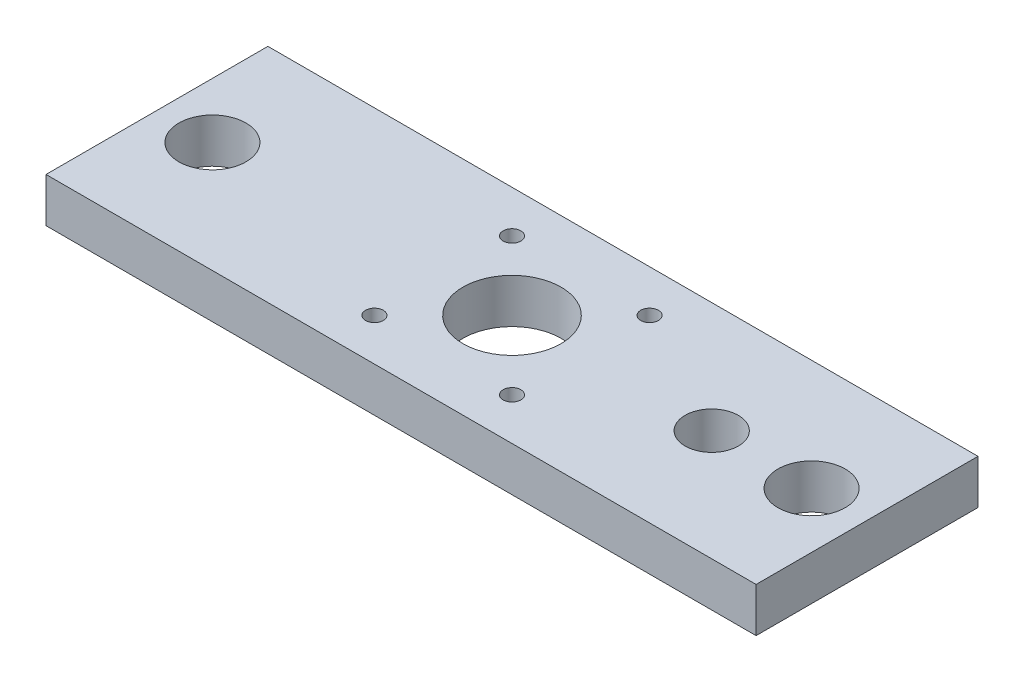
ISO-10303-21;
HEADER;
FILE_DESCRIPTION(('STEP AP214'),'2;1');
FILE_NAME('part.step','',(''),(''),'','','');
FILE_SCHEMA(('AUTOMOTIVE_DESIGN { 1 0 10303 214 1 1 1 1 }'));
ENDSEC;
DATA;
#1=APPLICATION_CONTEXT('core data for automotive mechanical design processes');
#2=APPLICATION_PROTOCOL_DEFINITION('international standard','automotive_design',2000,#1);
#3=PRODUCT_CONTEXT('',#1,'mechanical');
#4=PRODUCT('Part','Part','',(#3));
#5=PRODUCT_RELATED_PRODUCT_CATEGORY('part','',(#4));
#6=PRODUCT_DEFINITION_FORMATION('','',#4);
#7=PRODUCT_DEFINITION_CONTEXT('part definition',#1,'design');
#8=PRODUCT_DEFINITION('design','',#6,#7);
#9=PRODUCT_DEFINITION_SHAPE('','',#8);
#10=(LENGTH_UNIT() NAMED_UNIT(*) SI_UNIT(.MILLI.,.METRE.));
#11=(NAMED_UNIT(*) PLANE_ANGLE_UNIT() SI_UNIT($,.RADIAN.));
#12=(NAMED_UNIT(*) SI_UNIT($,.STERADIAN.) SOLID_ANGLE_UNIT());
#13=UNCERTAINTY_MEASURE_WITH_UNIT(LENGTH_MEASURE(1.E-05),#10,'distance_accuracy_value','');
#14=(GEOMETRIC_REPRESENTATION_CONTEXT(3) GLOBAL_UNCERTAINTY_ASSIGNED_CONTEXT((#13)) GLOBAL_UNIT_ASSIGNED_CONTEXT((#10,
#11,#12)) REPRESENTATION_CONTEXT('',''));
#15=CARTESIAN_POINT('',(0.,0.,0.));
#16=DIRECTION('',(0.,0.,1.));
#17=DIRECTION('',(1.,0.,0.));
#18=AXIS2_PLACEMENT_3D('',#15,#16,#17);
#19=CARTESIAN_POINT('',(0.,10.,0.));
#20=DIRECTION('',(0.,-1.,0.));
#21=DIRECTION('',(0.,0.,-1.));
#22=AXIS2_PLACEMENT_3D('',#19,#20,#21);
#23=PLANE('',#22);
#24=DIRECTION('',(0.,0.,-1.));
#25=VECTOR('',#24,1.);
#26=CARTESIAN_POINT('',(80.,10.,25.));
#27=LINE('',#26,#25);
#28=CARTESIAN_POINT('',(80.,10.,25.));
#29=VERTEX_POINT('',#28);
#30=CARTESIAN_POINT('',(80.,10.,-25.));
#31=VERTEX_POINT('',#30);
#32=EDGE_CURVE('E88',#29,#31,#27,.T.);
#33=ORIENTED_EDGE('',*,*,#32,.T.);
#34=DIRECTION('',(-1.,0.,0.));
#35=VECTOR('',#34,1.);
#36=CARTESIAN_POINT('',(-80.,10.,-25.));
#37=LINE('',#36,#35);
#38=CARTESIAN_POINT('',(-80.,10.,-25.));
#39=VERTEX_POINT('',#38);
#40=EDGE_CURVE('E83',#31,#39,#37,.T.);
#41=ORIENTED_EDGE('',*,*,#40,.T.);
#42=DIRECTION('',(0.,0.,1.));
#43=VECTOR('',#42,1.);
#44=CARTESIAN_POINT('',(-80.,10.,25.));
#45=LINE('',#44,#43);
#46=CARTESIAN_POINT('',(-80.,10.,25.));
#47=VERTEX_POINT('',#46);
#48=EDGE_CURVE('E86',#39,#47,#45,.T.);
#49=ORIENTED_EDGE('',*,*,#48,.T.);
#50=DIRECTION('',(1.,0.,0.));
#51=VECTOR('',#50,1.);
#52=CARTESIAN_POINT('',(-80.,10.,25.));
#53=LINE('',#52,#51);
#54=EDGE_CURVE('E53',#47,#29,#53,.T.);
#55=ORIENTED_EDGE('',*,*,#54,.T.);
#56=EDGE_LOOP('',(#33,#41,#49,#55));
#57=FACE_BOUND('',#56,.T.);
#58=CARTESIAN_POINT('',(0.,10.,0.));
#59=DIRECTION('',(0.,1.,0.));
#60=DIRECTION('',(0.,0.,1.));
#61=AXIS2_PLACEMENT_3D('',#58,#59,#60);
#62=CIRCLE('',#61,11.05);
#63=CARTESIAN_POINT('',(0.,10.,11.05));
#64=VERTEX_POINT('',#63);
#65=EDGE_CURVE('E103',#64,#64,#62,.T.);
#66=ORIENTED_EDGE('',*,*,#65,.F.);
#67=EDGE_LOOP('',(#66));
#68=FACE_BOUND('',#67,.T.);
#69=CARTESIAN_POINT('',(15.5,10.,-15.5));
#70=DIRECTION('',(0.,1.,0.));
#71=DIRECTION('',(0.,0.,1.));
#72=AXIS2_PLACEMENT_3D('',#69,#70,#71);
#73=CIRCLE('',#72,2.);
#74=CARTESIAN_POINT('',(15.5,10.,-13.5));
#75=VERTEX_POINT('',#74);
#76=EDGE_CURVE('E118',#75,#75,#73,.T.);
#77=ORIENTED_EDGE('',*,*,#76,.F.);
#78=EDGE_LOOP('',(#77));
#79=FACE_BOUND('',#78,.T.);
#80=CARTESIAN_POINT('',(-15.5,10.,-15.5));
#81=DIRECTION('',(0.,1.,0.));
#82=DIRECTION('',(0.,0.,1.));
#83=AXIS2_PLACEMENT_3D('',#80,#81,#82);
#84=CIRCLE('',#83,2.);
#85=CARTESIAN_POINT('',(-15.5,10.,-13.5));
#86=VERTEX_POINT('',#85);
#87=EDGE_CURVE('E124',#86,#86,#84,.T.);
#88=ORIENTED_EDGE('',*,*,#87,.F.);
#89=EDGE_LOOP('',(#88));
#90=FACE_BOUND('',#89,.T.);
#91=CARTESIAN_POINT('',(-15.5,10.,15.5));
#92=DIRECTION('',(0.,1.,0.));
#93=DIRECTION('',(0.,0.,1.));
#94=AXIS2_PLACEMENT_3D('',#91,#92,#93);
#95=CIRCLE('',#94,2.);
#96=CARTESIAN_POINT('',(-15.5,10.,17.5));
#97=VERTEX_POINT('',#96);
#98=EDGE_CURVE('E130',#97,#97,#95,.T.);
#99=ORIENTED_EDGE('',*,*,#98,.F.);
#100=EDGE_LOOP('',(#99));
#101=FACE_BOUND('',#100,.T.);
#102=CARTESIAN_POINT('',(15.5,10.,15.5));
#103=DIRECTION('',(0.,1.,0.));
#104=DIRECTION('',(0.,0.,1.));
#105=AXIS2_PLACEMENT_3D('',#102,#103,#104);
#106=CIRCLE('',#105,2.);
#107=CARTESIAN_POINT('',(15.5,10.,17.5));
#108=VERTEX_POINT('',#107);
#109=EDGE_CURVE('E136',#108,#108,#106,.T.);
#110=ORIENTED_EDGE('',*,*,#109,.F.);
#111=EDGE_LOOP('',(#110));
#112=FACE_BOUND('',#111,.T.);
#113=CARTESIAN_POINT('',(-67.5,10.,0.));
#114=DIRECTION('',(0.,1.,0.));
#115=DIRECTION('',(0.,0.,1.));
#116=AXIS2_PLACEMENT_3D('',#113,#114,#115);
#117=CIRCLE('',#116,7.57499999999999);
#118=CARTESIAN_POINT('',(-67.5,10.,7.57499999999999));
#119=VERTEX_POINT('',#118);
#120=EDGE_CURVE('E142',#119,#119,#117,.T.);
#121=ORIENTED_EDGE('',*,*,#120,.F.);
#122=EDGE_LOOP('',(#121));
#123=FACE_BOUND('',#122,.T.);
#124=CARTESIAN_POINT('',(67.5,10.,0.));
#125=DIRECTION('',(0.,1.,0.));
#126=DIRECTION('',(0.,0.,1.));
#127=AXIS2_PLACEMENT_3D('',#124,#125,#126);
#128=CIRCLE('',#127,7.57499999999999);
#129=CARTESIAN_POINT('',(67.5,10.,7.57499999999997));
#130=VERTEX_POINT('',#129);
#131=EDGE_CURVE('E148',#130,#130,#128,.T.);
#132=ORIENTED_EDGE('',*,*,#131,.F.);
#133=EDGE_LOOP('',(#132));
#134=FACE_BOUND('',#133,.T.);
#135=CARTESIAN_POINT('',(45.,10.,0.));
#136=DIRECTION('',(0.,1.,0.));
#137=DIRECTION('',(0.,0.,1.));
#138=AXIS2_PLACEMENT_3D('',#135,#136,#137);
#139=CIRCLE('',#138,6.);
#140=CARTESIAN_POINT('',(45.,10.,6.));
#141=VERTEX_POINT('',#140);
#142=EDGE_CURVE('E154',#141,#141,#139,.T.);
#143=ORIENTED_EDGE('',*,*,#142,.F.);
#144=EDGE_LOOP('',(#143));
#145=FACE_BOUND('',#144,.T.);
#146=ADVANCED_FACE('F36',(#57,#68,#79,#90,#101,#112,#123,#134,#145),#23,.F.);
#147=CARTESIAN_POINT('',(0.,0.,0.));
#148=DIRECTION('',(0.,-1.,0.));
#149=DIRECTION('',(0.,0.,-1.));
#150=AXIS2_PLACEMENT_3D('',#147,#148,#149);
#151=PLANE('',#150);
#152=CARTESIAN_POINT('',(67.5,0.,0.));
#153=DIRECTION('',(0.,1.,0.));
#154=DIRECTION('',(0.,0.,1.));
#155=AXIS2_PLACEMENT_3D('',#152,#153,#154);
#156=CIRCLE('',#155,7.57499999999999);
#157=CARTESIAN_POINT('',(67.5,0.,7.57499999999997));
#158=VERTEX_POINT('',#157);
#159=EDGE_CURVE('E151',#158,#158,#156,.T.);
#160=ORIENTED_EDGE('',*,*,#159,.T.);
#161=EDGE_LOOP('',(#160));
#162=FACE_BOUND('',#161,.T.);
#163=CARTESIAN_POINT('',(15.5,0.,15.5));
#164=DIRECTION('',(0.,1.,0.));
#165=DIRECTION('',(0.,0.,1.));
#166=AXIS2_PLACEMENT_3D('',#163,#164,#165);
#167=CIRCLE('',#166,2.);
#168=CARTESIAN_POINT('',(15.5,0.,17.5));
#169=VERTEX_POINT('',#168);
#170=EDGE_CURVE('E139',#169,#169,#167,.T.);
#171=ORIENTED_EDGE('',*,*,#170,.T.);
#172=EDGE_LOOP('',(#171));
#173=FACE_BOUND('',#172,.T.);
#174=CARTESIAN_POINT('',(-15.5,0.,-15.5));
#175=DIRECTION('',(0.,1.,0.));
#176=DIRECTION('',(0.,0.,1.));
#177=AXIS2_PLACEMENT_3D('',#174,#175,#176);
#178=CIRCLE('',#177,2.);
#179=CARTESIAN_POINT('',(-15.5,0.,-13.5));
#180=VERTEX_POINT('',#179);
#181=EDGE_CURVE('E127',#180,#180,#178,.T.);
#182=ORIENTED_EDGE('',*,*,#181,.T.);
#183=EDGE_LOOP('',(#182));
#184=FACE_BOUND('',#183,.T.);
#185=CARTESIAN_POINT('',(0.,0.,0.));
#186=DIRECTION('',(0.,1.,0.));
#187=DIRECTION('',(0.,0.,1.));
#188=AXIS2_PLACEMENT_3D('',#185,#186,#187);
#189=CIRCLE('',#188,11.05);
#190=CARTESIAN_POINT('',(0.,0.,11.05));
#191=VERTEX_POINT('',#190);
#192=EDGE_CURVE('E115',#191,#191,#189,.T.);
#193=ORIENTED_EDGE('',*,*,#192,.T.);
#194=EDGE_LOOP('',(#193));
#195=FACE_BOUND('',#194,.T.);
#196=DIRECTION('',(0.,0.,-1.));
#197=VECTOR('',#196,1.);
#198=CARTESIAN_POINT('',(80.,0.,25.));
#199=LINE('',#198,#197);
#200=CARTESIAN_POINT('',(80.,0.,25.));
#201=VERTEX_POINT('',#200);
#202=CARTESIAN_POINT('',(80.,0.,-25.));
#203=VERTEX_POINT('',#202);
#204=EDGE_CURVE('E100',#201,#203,#199,.T.);
#205=ORIENTED_EDGE('',*,*,#204,.F.);
#206=DIRECTION('',(1.,0.,0.));
#207=VECTOR('',#206,1.);
#208=CARTESIAN_POINT('',(-80.,0.,25.));
#209=LINE('',#208,#207);
#210=CARTESIAN_POINT('',(-80.,0.,25.));
#211=VERTEX_POINT('',#210);
#212=EDGE_CURVE('E76',#211,#201,#209,.T.);
#213=ORIENTED_EDGE('',*,*,#212,.F.);
#214=DIRECTION('',(0.,0.,1.));
#215=VECTOR('',#214,1.);
#216=CARTESIAN_POINT('',(-80.,0.,25.));
#217=LINE('',#216,#215);
#218=CARTESIAN_POINT('',(-80.,0.,-25.));
#219=VERTEX_POINT('',#218);
#220=EDGE_CURVE('E70',#219,#211,#217,.T.);
#221=ORIENTED_EDGE('',*,*,#220,.F.);
#222=DIRECTION('',(-1.,0.,0.));
#223=VECTOR('',#222,1.);
#224=CARTESIAN_POINT('',(-80.,0.,-25.));
#225=LINE('',#224,#223);
#226=EDGE_CURVE('E92',#203,#219,#225,.T.);
#227=ORIENTED_EDGE('',*,*,#226,.F.);
#228=EDGE_LOOP('',(#205,#213,#221,#227));
#229=FACE_BOUND('',#228,.T.);
#230=CARTESIAN_POINT('',(15.5,0.,-15.5));
#231=DIRECTION('',(0.,1.,0.));
#232=DIRECTION('',(0.,0.,1.));
#233=AXIS2_PLACEMENT_3D('',#230,#231,#232);
#234=CIRCLE('',#233,2.);
#235=CARTESIAN_POINT('',(15.5,0.,-13.5));
#236=VERTEX_POINT('',#235);
#237=EDGE_CURVE('E121',#236,#236,#234,.T.);
#238=ORIENTED_EDGE('',*,*,#237,.T.);
#239=EDGE_LOOP('',(#238));
#240=FACE_BOUND('',#239,.T.);
#241=CARTESIAN_POINT('',(-15.5,0.,15.5));
#242=DIRECTION('',(0.,1.,0.));
#243=DIRECTION('',(0.,0.,1.));
#244=AXIS2_PLACEMENT_3D('',#241,#242,#243);
#245=CIRCLE('',#244,2.);
#246=CARTESIAN_POINT('',(-15.5,0.,17.5));
#247=VERTEX_POINT('',#246);
#248=EDGE_CURVE('E133',#247,#247,#245,.T.);
#249=ORIENTED_EDGE('',*,*,#248,.T.);
#250=EDGE_LOOP('',(#249));
#251=FACE_BOUND('',#250,.T.);
#252=CARTESIAN_POINT('',(-67.5,0.,0.));
#253=DIRECTION('',(0.,1.,0.));
#254=DIRECTION('',(0.,0.,1.));
#255=AXIS2_PLACEMENT_3D('',#252,#253,#254);
#256=CIRCLE('',#255,7.57499999999999);
#257=CARTESIAN_POINT('',(-67.5,0.,7.57499999999999));
#258=VERTEX_POINT('',#257);
#259=EDGE_CURVE('E145',#258,#258,#256,.T.);
#260=ORIENTED_EDGE('',*,*,#259,.T.);
#261=EDGE_LOOP('',(#260));
#262=FACE_BOUND('',#261,.T.);
#263=CARTESIAN_POINT('',(45.,0.,0.));
#264=DIRECTION('',(0.,1.,0.));
#265=DIRECTION('',(0.,0.,1.));
#266=AXIS2_PLACEMENT_3D('',#263,#264,#265);
#267=CIRCLE('',#266,6.);
#268=CARTESIAN_POINT('',(45.,0.,6.));
#269=VERTEX_POINT('',#268);
#270=EDGE_CURVE('E157',#269,#269,#267,.T.);
#271=ORIENTED_EDGE('',*,*,#270,.T.);
#272=EDGE_LOOP('',(#271));
#273=FACE_BOUND('',#272,.T.);
#274=ADVANCED_FACE('F111',(#162,#173,#184,#195,#229,#240,#251,#262,#273),#151,.T.);
#275=CARTESIAN_POINT('',(80.,10.,25.));
#276=DIRECTION('',(-1.,0.,0.));
#277=DIRECTION('',(0.,0.,1.));
#278=AXIS2_PLACEMENT_3D('',#275,#276,#277);
#279=PLANE('',#278);
#280=ORIENTED_EDGE('',*,*,#204,.T.);
#281=DIRECTION('',(0.,-1.,0.));
#282=VECTOR('',#281,1.);
#283=CARTESIAN_POINT('',(80.,10.,-25.));
#284=LINE('',#283,#282);
#285=EDGE_CURVE('E11',#31,#203,#284,.T.);
#286=ORIENTED_EDGE('',*,*,#285,.F.);
#287=ORIENTED_EDGE('',*,*,#32,.F.);
#288=DIRECTION('',(0.,-1.,0.));
#289=VECTOR('',#288,1.);
#290=CARTESIAN_POINT('',(80.,10.,25.));
#291=LINE('',#290,#289);
#292=EDGE_CURVE('E96',#29,#201,#291,.T.);
#293=ORIENTED_EDGE('',*,*,#292,.T.);
#294=EDGE_LOOP('',(#280,#286,#287,#293));
#295=FACE_BOUND('',#294,.T.);
#296=ADVANCED_FACE('F38',(#295),#279,.F.);
#297=CARTESIAN_POINT('',(-80.,10.,-25.));
#298=DIRECTION('',(0.,0.,1.));
#299=DIRECTION('',(1.,0.,0.));
#300=AXIS2_PLACEMENT_3D('',#297,#298,#299);
#301=PLANE('',#300);
#302=ORIENTED_EDGE('',*,*,#226,.T.);
#303=DIRECTION('',(0.,-1.,0.));
#304=VECTOR('',#303,1.);
#305=CARTESIAN_POINT('',(-80.,10.,-25.));
#306=LINE('',#305,#304);
#307=EDGE_CURVE('E45',#39,#219,#306,.T.);
#308=ORIENTED_EDGE('',*,*,#307,.F.);
#309=ORIENTED_EDGE('',*,*,#40,.F.);
#310=ORIENTED_EDGE('',*,*,#285,.T.);
#311=EDGE_LOOP('',(#302,#308,#309,#310));
#312=FACE_BOUND('',#311,.T.);
#313=ADVANCED_FACE('F91',(#312),#301,.F.);
#314=CARTESIAN_POINT('',(-80.,10.,25.));
#315=DIRECTION('',(1.,0.,0.));
#316=DIRECTION('',(0.,0.,-1.));
#317=AXIS2_PLACEMENT_3D('',#314,#315,#316);
#318=PLANE('',#317);
#319=ORIENTED_EDGE('',*,*,#220,.T.);
#320=DIRECTION('',(0.,-1.,0.));
#321=VECTOR('',#320,1.);
#322=CARTESIAN_POINT('',(-80.,10.,25.));
#323=LINE('',#322,#321);
#324=EDGE_CURVE('E93',#47,#211,#323,.T.);
#325=ORIENTED_EDGE('',*,*,#324,.F.);
#326=ORIENTED_EDGE('',*,*,#48,.F.);
#327=ORIENTED_EDGE('',*,*,#307,.T.);
#328=EDGE_LOOP('',(#319,#325,#326,#327));
#329=FACE_BOUND('',#328,.T.);
#330=ADVANCED_FACE('F94',(#329),#318,.F.);
#331=CARTESIAN_POINT('',(-80.,10.,25.));
#332=DIRECTION('',(0.,0.,-1.));
#333=DIRECTION('',(-1.,0.,0.));
#334=AXIS2_PLACEMENT_3D('',#331,#332,#333);
#335=PLANE('',#334);
#336=ORIENTED_EDGE('',*,*,#212,.T.);
#337=ORIENTED_EDGE('',*,*,#292,.F.);
#338=ORIENTED_EDGE('',*,*,#54,.F.);
#339=ORIENTED_EDGE('',*,*,#324,.T.);
#340=EDGE_LOOP('',(#336,#337,#338,#339));
#341=FACE_BOUND('',#340,.T.);
#342=ADVANCED_FACE('F108',(#341),#335,.F.);
#343=CARTESIAN_POINT('',(0.,10.,0.));
#344=DIRECTION('',(0.,-1.,0.));
#345=DIRECTION('',(0.,0.,-1.));
#346=AXIS2_PLACEMENT_3D('',#343,#344,#345);
#347=CYLINDRICAL_SURFACE('',#346,11.05);
#348=ORIENTED_EDGE('',*,*,#65,.T.);
#349=EDGE_LOOP('',(#348));
#350=FACE_BOUND('',#349,.T.);
#351=ORIENTED_EDGE('',*,*,#192,.F.);
#352=EDGE_LOOP('',(#351));
#353=FACE_BOUND('',#352,.T.);
#354=ADVANCED_FACE('F174',(#350,#353),#347,.F.);
#355=CARTESIAN_POINT('',(15.5,10.,-15.5));
#356=DIRECTION('',(0.,-1.,0.));
#357=DIRECTION('',(0.,0.,-1.));
#358=AXIS2_PLACEMENT_3D('',#355,#356,#357);
#359=CYLINDRICAL_SURFACE('',#358,2.);
#360=ORIENTED_EDGE('',*,*,#76,.T.);
#361=EDGE_LOOP('',(#360));
#362=FACE_BOUND('',#361,.T.);
#363=ORIENTED_EDGE('',*,*,#237,.F.);
#364=EDGE_LOOP('',(#363));
#365=FACE_BOUND('',#364,.T.);
#366=ADVANCED_FACE('F220',(#362,#365),#359,.F.);
#367=CARTESIAN_POINT('',(-15.5,10.,-15.5));
#368=DIRECTION('',(0.,-1.,0.));
#369=DIRECTION('',(0.,0.,-1.));
#370=AXIS2_PLACEMENT_3D('',#367,#368,#369);
#371=CYLINDRICAL_SURFACE('',#370,2.);
#372=ORIENTED_EDGE('',*,*,#87,.T.);
#373=EDGE_LOOP('',(#372));
#374=FACE_BOUND('',#373,.T.);
#375=ORIENTED_EDGE('',*,*,#181,.F.);
#376=EDGE_LOOP('',(#375));
#377=FACE_BOUND('',#376,.T.);
#378=ADVANCED_FACE('F228',(#374,#377),#371,.F.);
#379=CARTESIAN_POINT('',(-15.5,10.,15.5));
#380=DIRECTION('',(0.,-1.,0.));
#381=DIRECTION('',(0.,0.,-1.));
#382=AXIS2_PLACEMENT_3D('',#379,#380,#381);
#383=CYLINDRICAL_SURFACE('',#382,2.);
#384=ORIENTED_EDGE('',*,*,#98,.T.);
#385=EDGE_LOOP('',(#384));
#386=FACE_BOUND('',#385,.T.);
#387=ORIENTED_EDGE('',*,*,#248,.F.);
#388=EDGE_LOOP('',(#387));
#389=FACE_BOUND('',#388,.T.);
#390=ADVANCED_FACE('F236',(#386,#389),#383,.F.);
#391=CARTESIAN_POINT('',(15.5,10.,15.5));
#392=DIRECTION('',(0.,-1.,0.));
#393=DIRECTION('',(0.,0.,-1.));
#394=AXIS2_PLACEMENT_3D('',#391,#392,#393);
#395=CYLINDRICAL_SURFACE('',#394,2.);
#396=ORIENTED_EDGE('',*,*,#109,.T.);
#397=EDGE_LOOP('',(#396));
#398=FACE_BOUND('',#397,.T.);
#399=ORIENTED_EDGE('',*,*,#170,.F.);
#400=EDGE_LOOP('',(#399));
#401=FACE_BOUND('',#400,.T.);
#402=ADVANCED_FACE('F245',(#398,#401),#395,.F.);
#403=CARTESIAN_POINT('',(-67.5,10.,0.));
#404=DIRECTION('',(0.,-1.,0.));
#405=DIRECTION('',(0.,0.,-1.));
#406=AXIS2_PLACEMENT_3D('',#403,#404,#405);
#407=CYLINDRICAL_SURFACE('',#406,7.57499999999999);
#408=ORIENTED_EDGE('',*,*,#120,.T.);
#409=EDGE_LOOP('',(#408));
#410=FACE_BOUND('',#409,.T.);
#411=ORIENTED_EDGE('',*,*,#259,.F.);
#412=EDGE_LOOP('',(#411));
#413=FACE_BOUND('',#412,.T.);
#414=ADVANCED_FACE('F254',(#410,#413),#407,.F.);
#415=CARTESIAN_POINT('',(67.5,10.,0.));
#416=DIRECTION('',(0.,-1.,0.));
#417=DIRECTION('',(0.,0.,-1.));
#418=AXIS2_PLACEMENT_3D('',#415,#416,#417);
#419=CYLINDRICAL_SURFACE('',#418,7.57499999999999);
#420=ORIENTED_EDGE('',*,*,#131,.T.);
#421=EDGE_LOOP('',(#420));
#422=FACE_BOUND('',#421,.T.);
#423=ORIENTED_EDGE('',*,*,#159,.F.);
#424=EDGE_LOOP('',(#423));
#425=FACE_BOUND('',#424,.T.);
#426=ADVANCED_FACE('F263',(#422,#425),#419,.F.);
#427=CARTESIAN_POINT('',(45.,10.,0.));
#428=DIRECTION('',(0.,-1.,0.));
#429=DIRECTION('',(0.,0.,-1.));
#430=AXIS2_PLACEMENT_3D('',#427,#428,#429);
#431=CYLINDRICAL_SURFACE('',#430,6.);
#432=ORIENTED_EDGE('',*,*,#142,.T.);
#433=EDGE_LOOP('',(#432));
#434=FACE_BOUND('',#433,.T.);
#435=ORIENTED_EDGE('',*,*,#270,.F.);
#436=EDGE_LOOP('',(#435));
#437=FACE_BOUND('',#436,.T.);
#438=ADVANCED_FACE('F163',(#434,#437),#431,.F.);
#439=CLOSED_SHELL('',(#146,#274,#296,#313,#330,#342,#354,#366,#378,#390,#402,#414,#426,#438));
#440=MANIFOLD_SOLID_BREP('B2',#439);
#441=ADVANCED_BREP_SHAPE_REPRESENTATION('',(#18,#440),#14);
#442=SHAPE_DEFINITION_REPRESENTATION(#9,#441);
ENDSEC;
END-ISO-10303-21;
